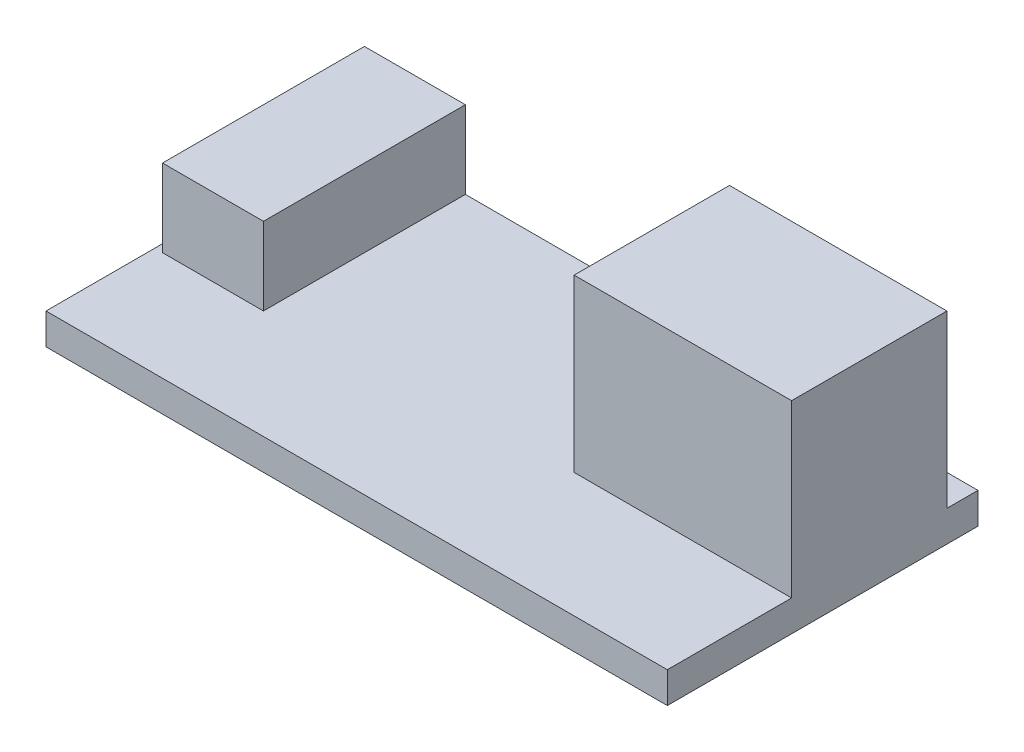
ISO-10303-21;
HEADER;
FILE_DESCRIPTION(('STEP AP214'),'2;1');
FILE_NAME('part.step','',(''),(''),'','','');
FILE_SCHEMA(('AUTOMOTIVE_DESIGN { 1 0 10303 214 1 1 1 1 }'));
ENDSEC;
DATA;
#1=APPLICATION_CONTEXT('core data for automotive mechanical design processes');
#2=APPLICATION_PROTOCOL_DEFINITION('international standard','automotive_design',2000,#1);
#3=PRODUCT_CONTEXT('',#1,'mechanical');
#4=PRODUCT('Part','Part','',(#3));
#5=PRODUCT_RELATED_PRODUCT_CATEGORY('part','',(#4));
#6=PRODUCT_DEFINITION_FORMATION('','',#4);
#7=PRODUCT_DEFINITION_CONTEXT('part definition',#1,'design');
#8=PRODUCT_DEFINITION('design','',#6,#7);
#9=PRODUCT_DEFINITION_SHAPE('','',#8);
#10=(LENGTH_UNIT() NAMED_UNIT(*) SI_UNIT(.MILLI.,.METRE.));
#11=(NAMED_UNIT(*) PLANE_ANGLE_UNIT() SI_UNIT($,.RADIAN.));
#12=(NAMED_UNIT(*) SI_UNIT($,.STERADIAN.) SOLID_ANGLE_UNIT());
#13=UNCERTAINTY_MEASURE_WITH_UNIT(LENGTH_MEASURE(1.E-05),#10,'distance_accuracy_value','');
#14=(GEOMETRIC_REPRESENTATION_CONTEXT(3) GLOBAL_UNCERTAINTY_ASSIGNED_CONTEXT((#13)) GLOBAL_UNIT_ASSIGNED_CONTEXT((#10,
#11,#12)) REPRESENTATION_CONTEXT('',''));
#15=CARTESIAN_POINT('',(0.,0.,0.));
#16=DIRECTION('',(0.,0.,1.));
#17=DIRECTION('',(1.,0.,0.));
#18=AXIS2_PLACEMENT_3D('',#15,#16,#17);
#19=CARTESIAN_POINT('',(0.,2.,0.));
#20=DIRECTION('',(0.,-1.,0.));
#21=DIRECTION('',(0.,0.,-1.));
#22=AXIS2_PLACEMENT_3D('',#19,#20,#21);
#23=PLANE('',#22);
#24=DIRECTION('',(0.,0.,1.));
#25=VECTOR('',#24,1.);
#26=CARTESIAN_POINT('',(-19.5,2.,-10.));
#27=LINE('',#26,#25);
#28=CARTESIAN_POINT('',(-19.5,2.,-10.));
#29=VERTEX_POINT('',#28);
#30=CARTESIAN_POINT('',(-19.5,2.,3.));
#31=VERTEX_POINT('',#30);
#32=EDGE_CURVE('E142',#29,#31,#27,.T.);
#33=ORIENTED_EDGE('',*,*,#32,.F.);
#34=DIRECTION('',(-1.,0.,0.));
#35=VECTOR('',#34,1.);
#36=CARTESIAN_POINT('',(-20.,2.,-10.));
#37=LINE('',#36,#35);
#38=CARTESIAN_POINT('',(-20.,2.,-10.));
#39=VERTEX_POINT('',#38);
#40=EDGE_CURVE('E181',#29,#39,#37,.T.);
#41=ORIENTED_EDGE('',*,*,#40,.T.);
#42=DIRECTION('',(0.,0.,1.));
#43=VECTOR('',#42,1.);
#44=CARTESIAN_POINT('',(-20.,2.,10.));
#45=LINE('',#44,#43);
#46=CARTESIAN_POINT('',(-20.,2.,10.));
#47=VERTEX_POINT('',#46);
#48=EDGE_CURVE('E185',#39,#47,#45,.T.);
#49=ORIENTED_EDGE('',*,*,#48,.T.);
#50=DIRECTION('',(1.,0.,0.));
#51=VECTOR('',#50,1.);
#52=CARTESIAN_POINT('',(-20.,2.,10.));
#53=LINE('',#52,#51);
#54=CARTESIAN_POINT('',(20.,2.,10.));
#55=VERTEX_POINT('',#54);
#56=EDGE_CURVE('E187',#47,#55,#53,.T.);
#57=ORIENTED_EDGE('',*,*,#56,.T.);
#58=DIRECTION('',(0.,0.,-1.));
#59=VECTOR('',#58,1.);
#60=CARTESIAN_POINT('',(20.,2.,10.));
#61=LINE('',#60,#59);
#62=CARTESIAN_POINT('',(20.,2.,2.));
#63=VERTEX_POINT('',#62);
#64=EDGE_CURVE('E179',#55,#63,#61,.T.);
#65=ORIENTED_EDGE('',*,*,#64,.T.);
#66=DIRECTION('',(1.,0.,0.));
#67=VECTOR('',#66,1.);
#68=CARTESIAN_POINT('',(6.,2.,2.));
#69=LINE('',#68,#67);
#70=CARTESIAN_POINT('',(6.,2.,2.));
#71=VERTEX_POINT('',#70);
#72=EDGE_CURVE('E146',#71,#63,#69,.T.);
#73=ORIENTED_EDGE('',*,*,#72,.F.);
#74=DIRECTION('',(0.,0.,1.));
#75=VECTOR('',#74,1.);
#76=CARTESIAN_POINT('',(6.,2.,2.));
#77=LINE('',#76,#75);
#78=CARTESIAN_POINT('',(6.,2.,-8.));
#79=VERTEX_POINT('',#78);
#80=EDGE_CURVE('E143',#79,#71,#77,.T.);
#81=ORIENTED_EDGE('',*,*,#80,.F.);
#82=DIRECTION('',(-1.,0.,0.));
#83=VECTOR('',#82,1.);
#84=CARTESIAN_POINT('',(6.,2.,-8.));
#85=LINE('',#84,#83);
#86=CARTESIAN_POINT('',(20.,2.,-8.));
#87=VERTEX_POINT('',#86);
#88=EDGE_CURVE('E156',#87,#79,#85,.T.);
#89=ORIENTED_EDGE('',*,*,#88,.F.);
#90=CARTESIAN_POINT('',(20.,2.,-10.));
#91=VERTEX_POINT('',#90);
#92=EDGE_CURVE('E182',#87,#91,#61,.T.);
#93=ORIENTED_EDGE('',*,*,#92,.T.);
#94=CARTESIAN_POINT('',(-13.,2.,-10.));
#95=VERTEX_POINT('',#94);
#96=EDGE_CURVE('E183',#91,#95,#37,.T.);
#97=ORIENTED_EDGE('',*,*,#96,.T.);
#98=DIRECTION('',(0.,0.,-1.));
#99=VECTOR('',#98,1.);
#100=CARTESIAN_POINT('',(-13.,2.,-10.));
#101=LINE('',#100,#99);
#102=CARTESIAN_POINT('',(-13.,2.,3.));
#103=VERTEX_POINT('',#102);
#104=EDGE_CURVE('E53',#103,#95,#101,.T.);
#105=ORIENTED_EDGE('',*,*,#104,.F.);
#106=DIRECTION('',(1.,0.,0.));
#107=VECTOR('',#106,1.);
#108=CARTESIAN_POINT('',(-19.5,2.,3.));
#109=LINE('',#108,#107);
#110=EDGE_CURVE('E48',#31,#103,#109,.T.);
#111=ORIENTED_EDGE('',*,*,#110,.F.);
#112=EDGE_LOOP('',(#33,#41,#49,#57,#65,#73,#81,#89,#93,#97,#105,#111));
#113=FACE_BOUND('',#112,.T.);
#114=ADVANCED_FACE('F33',(#113),#23,.F.);
#115=CARTESIAN_POINT('',(20.,2.,10.));
#116=DIRECTION('',(-1.,0.,0.));
#117=DIRECTION('',(0.,0.,1.));
#118=AXIS2_PLACEMENT_3D('',#115,#116,#117);
#119=PLANE('',#118);
#120=DIRECTION('',(0.,0.,-1.));
#121=VECTOR('',#120,1.);
#122=CARTESIAN_POINT('',(20.,0.,10.));
#123=LINE('',#122,#121);
#124=CARTESIAN_POINT('',(20.,0.,10.));
#125=VERTEX_POINT('',#124);
#126=CARTESIAN_POINT('',(20.,0.,-10.));
#127=VERTEX_POINT('',#126);
#128=EDGE_CURVE('E178',#125,#127,#123,.T.);
#129=ORIENTED_EDGE('',*,*,#128,.T.);
#130=DIRECTION('',(0.,-1.,0.));
#131=VECTOR('',#130,1.);
#132=CARTESIAN_POINT('',(20.,2.,-10.));
#133=LINE('',#132,#131);
#134=EDGE_CURVE('E11',#91,#127,#133,.T.);
#135=ORIENTED_EDGE('',*,*,#134,.F.);
#136=ORIENTED_EDGE('',*,*,#92,.F.);
#137=DIRECTION('',(0.,-1.,0.));
#138=VECTOR('',#137,1.);
#139=CARTESIAN_POINT('',(20.,13.,-8.));
#140=LINE('',#139,#138);
#141=CARTESIAN_POINT('',(20.,13.,-8.));
#142=VERTEX_POINT('',#141);
#143=EDGE_CURVE('E169',#142,#87,#140,.T.);
#144=ORIENTED_EDGE('',*,*,#143,.F.);
#145=DIRECTION('',(0.,0.,-1.));
#146=VECTOR('',#145,1.);
#147=CARTESIAN_POINT('',(20.,13.,2.));
#148=LINE('',#147,#146);
#149=CARTESIAN_POINT('',(20.,13.,2.));
#150=VERTEX_POINT('',#149);
#151=EDGE_CURVE('E158',#150,#142,#148,.T.);
#152=ORIENTED_EDGE('',*,*,#151,.F.);
#153=DIRECTION('',(0.,-1.,0.));
#154=VECTOR('',#153,1.);
#155=CARTESIAN_POINT('',(20.,13.,2.));
#156=LINE('',#155,#154);
#157=EDGE_CURVE('E172',#150,#63,#156,.T.);
#158=ORIENTED_EDGE('',*,*,#157,.T.);
#159=ORIENTED_EDGE('',*,*,#64,.F.);
#160=DIRECTION('',(0.,-1.,0.));
#161=VECTOR('',#160,1.);
#162=CARTESIAN_POINT('',(20.,2.,10.));
#163=LINE('',#162,#161);
#164=EDGE_CURVE('E189',#55,#125,#163,.T.);
#165=ORIENTED_EDGE('',*,*,#164,.T.);
#166=EDGE_LOOP('',(#129,#135,#136,#144,#152,#158,#159,#165));
#167=FACE_BOUND('',#166,.T.);
#168=ADVANCED_FACE('F35',(#167),#119,.F.);
#169=CARTESIAN_POINT('',(-20.,2.,-10.));
#170=DIRECTION('',(0.,0.,1.));
#171=DIRECTION('',(1.,0.,0.));
#172=AXIS2_PLACEMENT_3D('',#169,#170,#171);
#173=PLANE('',#172);
#174=DIRECTION('',(-1.,0.,0.));
#175=VECTOR('',#174,1.);
#176=CARTESIAN_POINT('',(-20.,0.,-10.));
#177=LINE('',#176,#175);
#178=CARTESIAN_POINT('',(-20.,0.,-10.));
#179=VERTEX_POINT('',#178);
#180=EDGE_CURVE('E192',#127,#179,#177,.T.);
#181=ORIENTED_EDGE('',*,*,#180,.T.);
#182=DIRECTION('',(0.,-1.,0.));
#183=VECTOR('',#182,1.);
#184=CARTESIAN_POINT('',(-20.,2.,-10.));
#185=LINE('',#184,#183);
#186=EDGE_CURVE('E41',#39,#179,#185,.T.);
#187=ORIENTED_EDGE('',*,*,#186,.F.);
#188=ORIENTED_EDGE('',*,*,#40,.F.);
#189=DIRECTION('',(0.,-1.,0.));
#190=VECTOR('',#189,1.);
#191=CARTESIAN_POINT('',(-19.5,7.,-10.));
#192=LINE('',#191,#190);
#193=CARTESIAN_POINT('',(-19.5,7.,-10.));
#194=VERTEX_POINT('',#193);
#195=EDGE_CURVE('E240',#194,#29,#192,.T.);
#196=ORIENTED_EDGE('',*,*,#195,.F.);
#197=DIRECTION('',(-1.,0.,0.));
#198=VECTOR('',#197,1.);
#199=CARTESIAN_POINT('',(-19.5,7.,-10.));
#200=LINE('',#199,#198);
#201=CARTESIAN_POINT('',(-13.,7.,-10.));
#202=VERTEX_POINT('',#201);
#203=EDGE_CURVE('E136',#202,#194,#200,.T.);
#204=ORIENTED_EDGE('',*,*,#203,.F.);
#205=DIRECTION('',(0.,-1.,0.));
#206=VECTOR('',#205,1.);
#207=CARTESIAN_POINT('',(-13.,7.,-10.));
#208=LINE('',#207,#206);
#209=EDGE_CURVE('E148',#202,#95,#208,.T.);
#210=ORIENTED_EDGE('',*,*,#209,.T.);
#211=ORIENTED_EDGE('',*,*,#96,.F.);
#212=ORIENTED_EDGE('',*,*,#134,.T.);
#213=EDGE_LOOP('',(#181,#187,#188,#196,#204,#210,#211,#212));
#214=FACE_BOUND('',#213,.T.);
#215=ADVANCED_FACE('F237',(#214),#173,.F.);
#216=CARTESIAN_POINT('',(-20.,2.,10.));
#217=DIRECTION('',(1.,0.,0.));
#218=DIRECTION('',(0.,0.,-1.));
#219=AXIS2_PLACEMENT_3D('',#216,#217,#218);
#220=PLANE('',#219);
#221=DIRECTION('',(0.,0.,1.));
#222=VECTOR('',#221,1.);
#223=CARTESIAN_POINT('',(-20.,0.,10.));
#224=LINE('',#223,#222);
#225=CARTESIAN_POINT('',(-20.,0.,10.));
#226=VERTEX_POINT('',#225);
#227=EDGE_CURVE('E194',#179,#226,#224,.T.);
#228=ORIENTED_EDGE('',*,*,#227,.T.);
#229=DIRECTION('',(0.,-1.,0.));
#230=VECTOR('',#229,1.);
#231=CARTESIAN_POINT('',(-20.,2.,10.));
#232=LINE('',#231,#230);
#233=EDGE_CURVE('E200',#47,#226,#232,.T.);
#234=ORIENTED_EDGE('',*,*,#233,.F.);
#235=ORIENTED_EDGE('',*,*,#48,.F.);
#236=ORIENTED_EDGE('',*,*,#186,.T.);
#237=EDGE_LOOP('',(#228,#234,#235,#236));
#238=FACE_BOUND('',#237,.T.);
#239=ADVANCED_FACE('F207',(#238),#220,.F.);
#240=CARTESIAN_POINT('',(-20.,2.,10.));
#241=DIRECTION('',(0.,0.,-1.));
#242=DIRECTION('',(-1.,0.,0.));
#243=AXIS2_PLACEMENT_3D('',#240,#241,#242);
#244=PLANE('',#243);
#245=DIRECTION('',(1.,0.,0.));
#246=VECTOR('',#245,1.);
#247=CARTESIAN_POINT('',(-20.,0.,10.));
#248=LINE('',#247,#246);
#249=EDGE_CURVE('E196',#226,#125,#248,.T.);
#250=ORIENTED_EDGE('',*,*,#249,.T.);
#251=ORIENTED_EDGE('',*,*,#164,.F.);
#252=ORIENTED_EDGE('',*,*,#56,.F.);
#253=ORIENTED_EDGE('',*,*,#233,.T.);
#254=EDGE_LOOP('',(#250,#251,#252,#253));
#255=FACE_BOUND('',#254,.T.);
#256=ADVANCED_FACE('F216',(#255),#244,.F.);
#257=CARTESIAN_POINT('',(0.,0.,0.));
#258=DIRECTION('',(0.,-1.,0.));
#259=DIRECTION('',(0.,0.,-1.));
#260=AXIS2_PLACEMENT_3D('',#257,#258,#259);
#261=PLANE('',#260);
#262=ORIENTED_EDGE('',*,*,#128,.F.);
#263=ORIENTED_EDGE('',*,*,#249,.F.);
#264=ORIENTED_EDGE('',*,*,#227,.F.);
#265=ORIENTED_EDGE('',*,*,#180,.F.);
#266=EDGE_LOOP('',(#262,#263,#264,#265));
#267=FACE_BOUND('',#266,.T.);
#268=ADVANCED_FACE('F213',(#267),#261,.T.);
#269=CARTESIAN_POINT('',(6.,13.,2.));
#270=DIRECTION('',(1.,0.,0.));
#271=DIRECTION('',(0.,0.,-1.));
#272=AXIS2_PLACEMENT_3D('',#269,#270,#271);
#273=PLANE('',#272);
#274=ORIENTED_EDGE('',*,*,#80,.T.);
#275=DIRECTION('',(0.,-1.,0.));
#276=VECTOR('',#275,1.);
#277=CARTESIAN_POINT('',(6.,13.,2.));
#278=LINE('',#277,#276);
#279=CARTESIAN_POINT('',(6.,13.,2.));
#280=VERTEX_POINT('',#279);
#281=EDGE_CURVE('E175',#280,#71,#278,.T.);
#282=ORIENTED_EDGE('',*,*,#281,.F.);
#283=DIRECTION('',(0.,0.,1.));
#284=VECTOR('',#283,1.);
#285=CARTESIAN_POINT('',(6.,13.,2.));
#286=LINE('',#285,#284);
#287=CARTESIAN_POINT('',(6.,13.,-8.));
#288=VERTEX_POINT('',#287);
#289=EDGE_CURVE('E152',#288,#280,#286,.T.);
#290=ORIENTED_EDGE('',*,*,#289,.F.);
#291=DIRECTION('',(0.,-1.,0.));
#292=VECTOR('',#291,1.);
#293=CARTESIAN_POINT('',(6.,13.,-8.));
#294=LINE('',#293,#292);
#295=EDGE_CURVE('E161',#288,#79,#294,.T.);
#296=ORIENTED_EDGE('',*,*,#295,.T.);
#297=EDGE_LOOP('',(#274,#282,#290,#296));
#298=FACE_BOUND('',#297,.T.);
#299=ADVANCED_FACE('F228',(#298),#273,.F.);
#300=CARTESIAN_POINT('',(6.,13.,2.));
#301=DIRECTION('',(0.,0.,-1.));
#302=DIRECTION('',(-1.,0.,0.));
#303=AXIS2_PLACEMENT_3D('',#300,#301,#302);
#304=PLANE('',#303);
#305=ORIENTED_EDGE('',*,*,#72,.T.);
#306=ORIENTED_EDGE('',*,*,#157,.F.);
#307=DIRECTION('',(1.,0.,0.));
#308=VECTOR('',#307,1.);
#309=CARTESIAN_POINT('',(6.,13.,2.));
#310=LINE('',#309,#308);
#311=EDGE_CURVE('E155',#280,#150,#310,.T.);
#312=ORIENTED_EDGE('',*,*,#311,.F.);
#313=ORIENTED_EDGE('',*,*,#281,.T.);
#314=EDGE_LOOP('',(#305,#306,#312,#313));
#315=FACE_BOUND('',#314,.T.);
#316=ADVANCED_FACE('F224',(#315),#304,.F.);
#317=CARTESIAN_POINT('',(6.,13.,-8.));
#318=DIRECTION('',(0.,0.,1.));
#319=DIRECTION('',(1.,0.,0.));
#320=AXIS2_PLACEMENT_3D('',#317,#318,#319);
#321=PLANE('',#320);
#322=ORIENTED_EDGE('',*,*,#88,.T.);
#323=ORIENTED_EDGE('',*,*,#295,.F.);
#324=DIRECTION('',(-1.,0.,0.));
#325=VECTOR('',#324,1.);
#326=CARTESIAN_POINT('',(6.,13.,-8.));
#327=LINE('',#326,#325);
#328=EDGE_CURVE('E160',#142,#288,#327,.T.);
#329=ORIENTED_EDGE('',*,*,#328,.F.);
#330=ORIENTED_EDGE('',*,*,#143,.T.);
#331=EDGE_LOOP('',(#322,#323,#329,#330));
#332=FACE_BOUND('',#331,.T.);
#333=ADVANCED_FACE('F232',(#332),#321,.F.);
#334=CARTESIAN_POINT('',(0.,13.,0.));
#335=DIRECTION('',(0.,-1.,0.));
#336=DIRECTION('',(0.,0.,-1.));
#337=AXIS2_PLACEMENT_3D('',#334,#335,#336);
#338=PLANE('',#337);
#339=ORIENTED_EDGE('',*,*,#289,.T.);
#340=ORIENTED_EDGE('',*,*,#311,.T.);
#341=ORIENTED_EDGE('',*,*,#151,.T.);
#342=ORIENTED_EDGE('',*,*,#328,.T.);
#343=EDGE_LOOP('',(#339,#340,#341,#342));
#344=FACE_BOUND('',#343,.T.);
#345=ADVANCED_FACE('F303',(#344),#338,.F.);
#346=CARTESIAN_POINT('',(-19.5,7.,-10.));
#347=DIRECTION('',(1.,0.,0.));
#348=DIRECTION('',(0.,0.,-1.));
#349=AXIS2_PLACEMENT_3D('',#346,#347,#348);
#350=PLANE('',#349);
#351=ORIENTED_EDGE('',*,*,#32,.T.);
#352=DIRECTION('',(0.,-1.,0.));
#353=VECTOR('',#352,1.);
#354=CARTESIAN_POINT('',(-19.5,7.,3.));
#355=LINE('',#354,#353);
#356=CARTESIAN_POINT('',(-19.5,7.,3.));
#357=VERTEX_POINT('',#356);
#358=EDGE_CURVE('E124',#357,#31,#355,.T.);
#359=ORIENTED_EDGE('',*,*,#358,.F.);
#360=DIRECTION('',(0.,0.,1.));
#361=VECTOR('',#360,1.);
#362=CARTESIAN_POINT('',(-19.5,7.,-10.));
#363=LINE('',#362,#361);
#364=EDGE_CURVE('E131',#194,#357,#363,.T.);
#365=ORIENTED_EDGE('',*,*,#364,.F.);
#366=ORIENTED_EDGE('',*,*,#195,.T.);
#367=EDGE_LOOP('',(#351,#359,#365,#366));
#368=FACE_BOUND('',#367,.T.);
#369=ADVANCED_FACE('F141',(#368),#350,.F.);
#370=CARTESIAN_POINT('',(-19.5,7.,3.));
#371=DIRECTION('',(0.,0.,-1.));
#372=DIRECTION('',(-1.,0.,0.));
#373=AXIS2_PLACEMENT_3D('',#370,#371,#372);
#374=PLANE('',#373);
#375=ORIENTED_EDGE('',*,*,#110,.T.);
#376=DIRECTION('',(0.,-1.,0.));
#377=VECTOR('',#376,1.);
#378=CARTESIAN_POINT('',(-13.,7.,3.));
#379=LINE('',#378,#377);
#380=CARTESIAN_POINT('',(-13.,7.,3.));
#381=VERTEX_POINT('',#380);
#382=EDGE_CURVE('E127',#381,#103,#379,.T.);
#383=ORIENTED_EDGE('',*,*,#382,.F.);
#384=DIRECTION('',(1.,0.,0.));
#385=VECTOR('',#384,1.);
#386=CARTESIAN_POINT('',(-19.5,7.,3.));
#387=LINE('',#386,#385);
#388=EDGE_CURVE('E120',#357,#381,#387,.T.);
#389=ORIENTED_EDGE('',*,*,#388,.F.);
#390=ORIENTED_EDGE('',*,*,#358,.T.);
#391=EDGE_LOOP('',(#375,#383,#389,#390));
#392=FACE_BOUND('',#391,.T.);
#393=ADVANCED_FACE('F122',(#392),#374,.F.);
#394=CARTESIAN_POINT('',(-13.,7.,-10.));
#395=DIRECTION('',(-1.,0.,0.));
#396=DIRECTION('',(0.,0.,1.));
#397=AXIS2_PLACEMENT_3D('',#394,#395,#396);
#398=PLANE('',#397);
#399=ORIENTED_EDGE('',*,*,#104,.T.);
#400=ORIENTED_EDGE('',*,*,#209,.F.);
#401=DIRECTION('',(0.,0.,-1.));
#402=VECTOR('',#401,1.);
#403=CARTESIAN_POINT('',(-13.,7.,-10.));
#404=LINE('',#403,#402);
#405=EDGE_CURVE('E130',#381,#202,#404,.T.);
#406=ORIENTED_EDGE('',*,*,#405,.F.);
#407=ORIENTED_EDGE('',*,*,#382,.T.);
#408=EDGE_LOOP('',(#399,#400,#406,#407));
#409=FACE_BOUND('',#408,.T.);
#410=ADVANCED_FACE('F247',(#409),#398,.F.);
#411=CARTESIAN_POINT('',(0.,7.,0.));
#412=DIRECTION('',(0.,1.,0.));
#413=DIRECTION('',(0.,0.,1.));
#414=AXIS2_PLACEMENT_3D('',#411,#412,#413);
#415=PLANE('',#414);
#416=ORIENTED_EDGE('',*,*,#364,.T.);
#417=ORIENTED_EDGE('',*,*,#388,.T.);
#418=ORIENTED_EDGE('',*,*,#405,.T.);
#419=ORIENTED_EDGE('',*,*,#203,.T.);
#420=EDGE_LOOP('',(#416,#417,#418,#419));
#421=FACE_BOUND('',#420,.T.);
#422=ADVANCED_FACE('F134',(#421),#415,.T.);
#423=CLOSED_SHELL('',(#114,#168,#215,#239,#256,#268,#299,#316,#333,#345,#369,#393,#410,#422));
#424=MANIFOLD_SOLID_BREP('B2',#423);
#425=ADVANCED_BREP_SHAPE_REPRESENTATION('',(#18,#424),#14);
#426=SHAPE_DEFINITION_REPRESENTATION(#9,#425);
ENDSEC;
END-ISO-10303-21;
